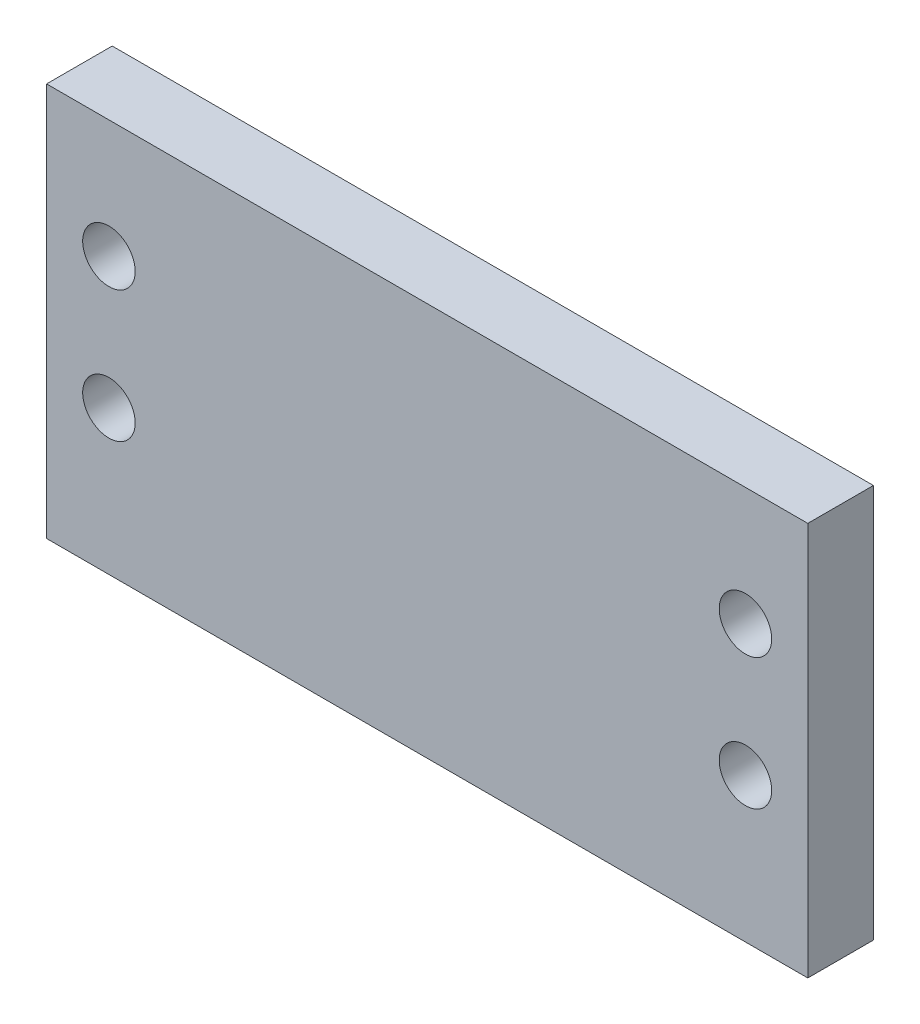
ISO-10303-21;
HEADER;
FILE_DESCRIPTION(('STEP AP214'),'2;1');
FILE_NAME('part.step','',(''),(''),'','','');
FILE_SCHEMA(('AUTOMOTIVE_DESIGN { 1 0 10303 214 1 1 1 1 }'));
ENDSEC;
DATA;
#1=APPLICATION_CONTEXT('core data for automotive mechanical design processes');
#2=APPLICATION_PROTOCOL_DEFINITION('international standard','automotive_design',2000,#1);
#3=PRODUCT_CONTEXT('',#1,'mechanical');
#4=PRODUCT('Part','Part','',(#3));
#5=PRODUCT_RELATED_PRODUCT_CATEGORY('part','',(#4));
#6=PRODUCT_DEFINITION_FORMATION('','',#4);
#7=PRODUCT_DEFINITION_CONTEXT('part definition',#1,'design');
#8=PRODUCT_DEFINITION('design','',#6,#7);
#9=PRODUCT_DEFINITION_SHAPE('','',#8);
#10=(LENGTH_UNIT() NAMED_UNIT(*) SI_UNIT(.MILLI.,.METRE.));
#11=(NAMED_UNIT(*) PLANE_ANGLE_UNIT() SI_UNIT($,.RADIAN.));
#12=(NAMED_UNIT(*) SI_UNIT($,.STERADIAN.) SOLID_ANGLE_UNIT());
#13=UNCERTAINTY_MEASURE_WITH_UNIT(LENGTH_MEASURE(1.E-05),#10,'distance_accuracy_value','');
#14=(GEOMETRIC_REPRESENTATION_CONTEXT(3) GLOBAL_UNCERTAINTY_ASSIGNED_CONTEXT((#13)) GLOBAL_UNIT_ASSIGNED_CONTEXT((#10,
#11,#12)) REPRESENTATION_CONTEXT('',''));
#15=CARTESIAN_POINT('',(0.,0.,0.));
#16=DIRECTION('',(0.,0.,1.));
#17=DIRECTION('',(1.,0.,0.));
#18=AXIS2_PLACEMENT_3D('',#15,#16,#17);
#19=CARTESIAN_POINT('',(0.,0.,5.));
#20=DIRECTION('',(0.,0.,1.));
#21=DIRECTION('',(1.,0.,0.));
#22=AXIS2_PLACEMENT_3D('',#19,#20,#21);
#23=PLANE('',#22);
#24=CARTESIAN_POINT('',(-4.75,21.,5.));
#25=DIRECTION('',(0.,0.,1.));
#26=DIRECTION('',(1.,0.,0.));
#27=AXIS2_PLACEMENT_3D('',#24,#25,#26);
#28=CIRCLE('',#27,2.);
#29=CARTESIAN_POINT('',(-2.75,21.,5.));
#30=VERTEX_POINT('',#29);
#31=EDGE_CURVE('E125',#30,#30,#28,.T.);
#32=ORIENTED_EDGE('',*,*,#31,.F.);
#33=EDGE_LOOP('',(#32));
#34=FACE_BOUND('',#33,.T.);
#35=CARTESIAN_POINT('',(-53.25,21.,5.));
#36=DIRECTION('',(0.,0.,1.));
#37=DIRECTION('',(1.,0.,0.));
#38=AXIS2_PLACEMENT_3D('',#35,#36,#37);
#39=CIRCLE('',#38,2.);
#40=CARTESIAN_POINT('',(-51.25,21.,5.));
#41=VERTEX_POINT('',#40);
#42=EDGE_CURVE('E104',#41,#41,#39,.T.);
#43=ORIENTED_EDGE('',*,*,#42,.F.);
#44=EDGE_LOOP('',(#43));
#45=FACE_BOUND('',#44,.T.);
#46=DIRECTION('',(0.,1.,0.));
#47=VECTOR('',#46,1.);
#48=CARTESIAN_POINT('',(0.,0.,5.));
#49=LINE('',#48,#47);
#50=CARTESIAN_POINT('',(0.,0.,5.));
#51=VERTEX_POINT('',#50);
#52=CARTESIAN_POINT('',(0.,30.,5.));
#53=VERTEX_POINT('',#52);
#54=EDGE_CURVE('E89',#51,#53,#49,.T.);
#55=ORIENTED_EDGE('',*,*,#54,.T.);
#56=DIRECTION('',(-1.,0.,0.));
#57=VECTOR('',#56,1.);
#58=CARTESIAN_POINT('',(0.,30.,5.));
#59=LINE('',#58,#57);
#60=CARTESIAN_POINT('',(-58.,30.,5.));
#61=VERTEX_POINT('',#60);
#62=EDGE_CURVE('E84',#53,#61,#59,.T.);
#63=ORIENTED_EDGE('',*,*,#62,.T.);
#64=DIRECTION('',(0.,-1.,0.));
#65=VECTOR('',#64,1.);
#66=CARTESIAN_POINT('',(-58.,0.,5.));
#67=LINE('',#66,#65);
#68=CARTESIAN_POINT('',(-58.,0.,5.));
#69=VERTEX_POINT('',#68);
#70=EDGE_CURVE('E87',#61,#69,#67,.T.);
#71=ORIENTED_EDGE('',*,*,#70,.T.);
#72=DIRECTION('',(1.,0.,0.));
#73=VECTOR('',#72,1.);
#74=CARTESIAN_POINT('',(0.,0.,5.));
#75=LINE('',#74,#73);
#76=EDGE_CURVE('E54',#69,#51,#75,.T.);
#77=ORIENTED_EDGE('',*,*,#76,.T.);
#78=EDGE_LOOP('',(#55,#63,#71,#77));
#79=FACE_BOUND('',#78,.T.);
#80=CARTESIAN_POINT('',(-53.25,11.,5.));
#81=DIRECTION('',(0.,0.,1.));
#82=DIRECTION('',(1.,0.,0.));
#83=AXIS2_PLACEMENT_3D('',#80,#81,#82);
#84=CIRCLE('',#83,2.);
#85=CARTESIAN_POINT('',(-51.25,11.,5.));
#86=VERTEX_POINT('',#85);
#87=EDGE_CURVE('E119',#86,#86,#84,.T.);
#88=ORIENTED_EDGE('',*,*,#87,.F.);
#89=EDGE_LOOP('',(#88));
#90=FACE_BOUND('',#89,.T.);
#91=CARTESIAN_POINT('',(-4.75,11.,5.));
#92=DIRECTION('',(0.,0.,1.));
#93=DIRECTION('',(1.,0.,0.));
#94=AXIS2_PLACEMENT_3D('',#91,#92,#93);
#95=CIRCLE('',#94,2.);
#96=CARTESIAN_POINT('',(-2.75,11.,5.));
#97=VERTEX_POINT('',#96);
#98=EDGE_CURVE('E131',#97,#97,#95,.T.);
#99=ORIENTED_EDGE('',*,*,#98,.F.);
#100=EDGE_LOOP('',(#99));
#101=FACE_BOUND('',#100,.T.);
#102=ADVANCED_FACE('F37',(#34,#45,#79,#90,#101),#23,.T.);
#103=CARTESIAN_POINT('',(0.,0.,0.));
#104=DIRECTION('',(0.,0.,1.));
#105=DIRECTION('',(1.,0.,0.));
#106=AXIS2_PLACEMENT_3D('',#103,#104,#105);
#107=PLANE('',#106);
#108=DIRECTION('',(0.,1.,0.));
#109=VECTOR('',#108,1.);
#110=CARTESIAN_POINT('',(0.,0.,0.));
#111=LINE('',#110,#109);
#112=CARTESIAN_POINT('',(0.,0.,0.));
#113=VERTEX_POINT('',#112);
#114=CARTESIAN_POINT('',(0.,30.,0.));
#115=VERTEX_POINT('',#114);
#116=EDGE_CURVE('E101',#113,#115,#111,.T.);
#117=ORIENTED_EDGE('',*,*,#116,.F.);
#118=DIRECTION('',(1.,0.,0.));
#119=VECTOR('',#118,1.);
#120=CARTESIAN_POINT('',(0.,0.,0.));
#121=LINE('',#120,#119);
#122=CARTESIAN_POINT('',(-58.,0.,0.));
#123=VERTEX_POINT('',#122);
#124=EDGE_CURVE('E77',#123,#113,#121,.T.);
#125=ORIENTED_EDGE('',*,*,#124,.F.);
#126=DIRECTION('',(0.,-1.,0.));
#127=VECTOR('',#126,1.);
#128=CARTESIAN_POINT('',(-58.,0.,0.));
#129=LINE('',#128,#127);
#130=CARTESIAN_POINT('',(-58.,30.,0.));
#131=VERTEX_POINT('',#130);
#132=EDGE_CURVE('E71',#131,#123,#129,.T.);
#133=ORIENTED_EDGE('',*,*,#132,.F.);
#134=DIRECTION('',(-1.,0.,0.));
#135=VECTOR('',#134,1.);
#136=CARTESIAN_POINT('',(0.,30.,0.));
#137=LINE('',#136,#135);
#138=EDGE_CURVE('E93',#115,#131,#137,.T.);
#139=ORIENTED_EDGE('',*,*,#138,.F.);
#140=EDGE_LOOP('',(#117,#125,#133,#139));
#141=FACE_BOUND('',#140,.T.);
#142=CARTESIAN_POINT('',(-53.25,21.,0.));
#143=DIRECTION('',(0.,0.,1.));
#144=DIRECTION('',(1.,0.,0.));
#145=AXIS2_PLACEMENT_3D('',#142,#143,#144);
#146=CIRCLE('',#145,2.);
#147=CARTESIAN_POINT('',(-51.25,21.,0.));
#148=VERTEX_POINT('',#147);
#149=EDGE_CURVE('E116',#148,#148,#146,.T.);
#150=ORIENTED_EDGE('',*,*,#149,.T.);
#151=EDGE_LOOP('',(#150));
#152=FACE_BOUND('',#151,.T.);
#153=CARTESIAN_POINT('',(-53.25,11.,0.));
#154=DIRECTION('',(0.,0.,1.));
#155=DIRECTION('',(1.,0.,0.));
#156=AXIS2_PLACEMENT_3D('',#153,#154,#155);
#157=CIRCLE('',#156,2.);
#158=CARTESIAN_POINT('',(-51.25,11.,0.));
#159=VERTEX_POINT('',#158);
#160=EDGE_CURVE('E122',#159,#159,#157,.T.);
#161=ORIENTED_EDGE('',*,*,#160,.T.);
#162=EDGE_LOOP('',(#161));
#163=FACE_BOUND('',#162,.T.);
#164=CARTESIAN_POINT('',(-4.75,21.,0.));
#165=DIRECTION('',(0.,0.,1.));
#166=DIRECTION('',(1.,0.,0.));
#167=AXIS2_PLACEMENT_3D('',#164,#165,#166);
#168=CIRCLE('',#167,2.);
#169=CARTESIAN_POINT('',(-2.75,21.,0.));
#170=VERTEX_POINT('',#169);
#171=EDGE_CURVE('E128',#170,#170,#168,.T.);
#172=ORIENTED_EDGE('',*,*,#171,.T.);
#173=EDGE_LOOP('',(#172));
#174=FACE_BOUND('',#173,.T.);
#175=CARTESIAN_POINT('',(-4.75,11.,0.));
#176=DIRECTION('',(0.,0.,1.));
#177=DIRECTION('',(1.,0.,0.));
#178=AXIS2_PLACEMENT_3D('',#175,#176,#177);
#179=CIRCLE('',#178,2.);
#180=CARTESIAN_POINT('',(-2.75,11.,0.));
#181=VERTEX_POINT('',#180);
#182=EDGE_CURVE('E134',#181,#181,#179,.T.);
#183=ORIENTED_EDGE('',*,*,#182,.T.);
#184=EDGE_LOOP('',(#183));
#185=FACE_BOUND('',#184,.T.);
#186=ADVANCED_FACE('F112',(#141,#152,#163,#174,#185),#107,.F.);
#187=CARTESIAN_POINT('',(0.,0.,5.));
#188=DIRECTION('',(-1.,0.,0.));
#189=DIRECTION('',(0.,0.,1.));
#190=AXIS2_PLACEMENT_3D('',#187,#188,#189);
#191=PLANE('',#190);
#192=ORIENTED_EDGE('',*,*,#116,.T.);
#193=DIRECTION('',(0.,0.,-1.));
#194=VECTOR('',#193,1.);
#195=CARTESIAN_POINT('',(0.,30.,5.));
#196=LINE('',#195,#194);
#197=EDGE_CURVE('E11',#53,#115,#196,.T.);
#198=ORIENTED_EDGE('',*,*,#197,.F.);
#199=ORIENTED_EDGE('',*,*,#54,.F.);
#200=DIRECTION('',(0.,0.,-1.));
#201=VECTOR('',#200,1.);
#202=CARTESIAN_POINT('',(0.,0.,5.));
#203=LINE('',#202,#201);
#204=EDGE_CURVE('E97',#51,#113,#203,.T.);
#205=ORIENTED_EDGE('',*,*,#204,.T.);
#206=EDGE_LOOP('',(#192,#198,#199,#205));
#207=FACE_BOUND('',#206,.T.);
#208=ADVANCED_FACE('F39',(#207),#191,.F.);
#209=CARTESIAN_POINT('',(0.,30.,5.));
#210=DIRECTION('',(0.,-1.,0.));
#211=DIRECTION('',(1.,0.,0.));
#212=AXIS2_PLACEMENT_3D('',#209,#210,#211);
#213=PLANE('',#212);
#214=ORIENTED_EDGE('',*,*,#138,.T.);
#215=DIRECTION('',(0.,0.,-1.));
#216=VECTOR('',#215,1.);
#217=CARTESIAN_POINT('',(-58.,30.,5.));
#218=LINE('',#217,#216);
#219=EDGE_CURVE('E46',#61,#131,#218,.T.);
#220=ORIENTED_EDGE('',*,*,#219,.F.);
#221=ORIENTED_EDGE('',*,*,#62,.F.);
#222=ORIENTED_EDGE('',*,*,#197,.T.);
#223=EDGE_LOOP('',(#214,#220,#221,#222));
#224=FACE_BOUND('',#223,.T.);
#225=ADVANCED_FACE('F92',(#224),#213,.F.);
#226=CARTESIAN_POINT('',(-58.,0.,5.));
#227=DIRECTION('',(1.,0.,0.));
#228=DIRECTION('',(0.,0.,-1.));
#229=AXIS2_PLACEMENT_3D('',#226,#227,#228);
#230=PLANE('',#229);
#231=ORIENTED_EDGE('',*,*,#132,.T.);
#232=DIRECTION('',(0.,0.,-1.));
#233=VECTOR('',#232,1.);
#234=CARTESIAN_POINT('',(-58.,0.,5.));
#235=LINE('',#234,#233);
#236=EDGE_CURVE('E94',#69,#123,#235,.T.);
#237=ORIENTED_EDGE('',*,*,#236,.F.);
#238=ORIENTED_EDGE('',*,*,#70,.F.);
#239=ORIENTED_EDGE('',*,*,#219,.T.);
#240=EDGE_LOOP('',(#231,#237,#238,#239));
#241=FACE_BOUND('',#240,.T.);
#242=ADVANCED_FACE('F95',(#241),#230,.F.);
#243=CARTESIAN_POINT('',(0.,0.,5.));
#244=DIRECTION('',(0.,1.,0.));
#245=DIRECTION('',(-1.,0.,0.));
#246=AXIS2_PLACEMENT_3D('',#243,#244,#245);
#247=PLANE('',#246);
#248=ORIENTED_EDGE('',*,*,#124,.T.);
#249=ORIENTED_EDGE('',*,*,#204,.F.);
#250=ORIENTED_EDGE('',*,*,#76,.F.);
#251=ORIENTED_EDGE('',*,*,#236,.T.);
#252=EDGE_LOOP('',(#248,#249,#250,#251));
#253=FACE_BOUND('',#252,.T.);
#254=ADVANCED_FACE('F109',(#253),#247,.F.);
#255=CARTESIAN_POINT('',(-53.25,21.,5.));
#256=DIRECTION('',(0.,0.,-1.));
#257=DIRECTION('',(-1.,0.,0.));
#258=AXIS2_PLACEMENT_3D('',#255,#256,#257);
#259=CYLINDRICAL_SURFACE('',#258,2.);
#260=ORIENTED_EDGE('',*,*,#42,.T.);
#261=EDGE_LOOP('',(#260));
#262=FACE_BOUND('',#261,.T.);
#263=ORIENTED_EDGE('',*,*,#149,.F.);
#264=EDGE_LOOP('',(#263));
#265=FACE_BOUND('',#264,.T.);
#266=ADVANCED_FACE('F153',(#262,#265),#259,.F.);
#267=CARTESIAN_POINT('',(-53.25,11.,5.));
#268=DIRECTION('',(0.,0.,-1.));
#269=DIRECTION('',(-1.,0.,0.));
#270=AXIS2_PLACEMENT_3D('',#267,#268,#269);
#271=CYLINDRICAL_SURFACE('',#270,2.);
#272=ORIENTED_EDGE('',*,*,#87,.T.);
#273=EDGE_LOOP('',(#272));
#274=FACE_BOUND('',#273,.T.);
#275=ORIENTED_EDGE('',*,*,#160,.F.);
#276=EDGE_LOOP('',(#275));
#277=FACE_BOUND('',#276,.T.);
#278=ADVANCED_FACE('F207',(#274,#277),#271,.F.);
#279=CARTESIAN_POINT('',(-4.75,21.,5.));
#280=DIRECTION('',(0.,0.,-1.));
#281=DIRECTION('',(-1.,0.,0.));
#282=AXIS2_PLACEMENT_3D('',#279,#280,#281);
#283=CYLINDRICAL_SURFACE('',#282,2.);
#284=ORIENTED_EDGE('',*,*,#31,.T.);
#285=EDGE_LOOP('',(#284));
#286=FACE_BOUND('',#285,.T.);
#287=ORIENTED_EDGE('',*,*,#171,.F.);
#288=EDGE_LOOP('',(#287));
#289=FACE_BOUND('',#288,.T.);
#290=ADVANCED_FACE('F216',(#286,#289),#283,.F.);
#291=CARTESIAN_POINT('',(-4.75,11.,5.));
#292=DIRECTION('',(0.,0.,-1.));
#293=DIRECTION('',(-1.,0.,0.));
#294=AXIS2_PLACEMENT_3D('',#291,#292,#293);
#295=CYLINDRICAL_SURFACE('',#294,2.);
#296=ORIENTED_EDGE('',*,*,#98,.T.);
#297=EDGE_LOOP('',(#296));
#298=FACE_BOUND('',#297,.T.);
#299=ORIENTED_EDGE('',*,*,#182,.F.);
#300=EDGE_LOOP('',(#299));
#301=FACE_BOUND('',#300,.T.);
#302=ADVANCED_FACE('F140',(#298,#301),#295,.F.);
#303=CLOSED_SHELL('',(#102,#186,#208,#225,#242,#254,#266,#278,#290,#302));
#304=MANIFOLD_SOLID_BREP('B2',#303);
#305=ADVANCED_BREP_SHAPE_REPRESENTATION('',(#18,#304),#14);
#306=SHAPE_DEFINITION_REPRESENTATION(#9,#305);
ENDSEC;
END-ISO-10303-21;
